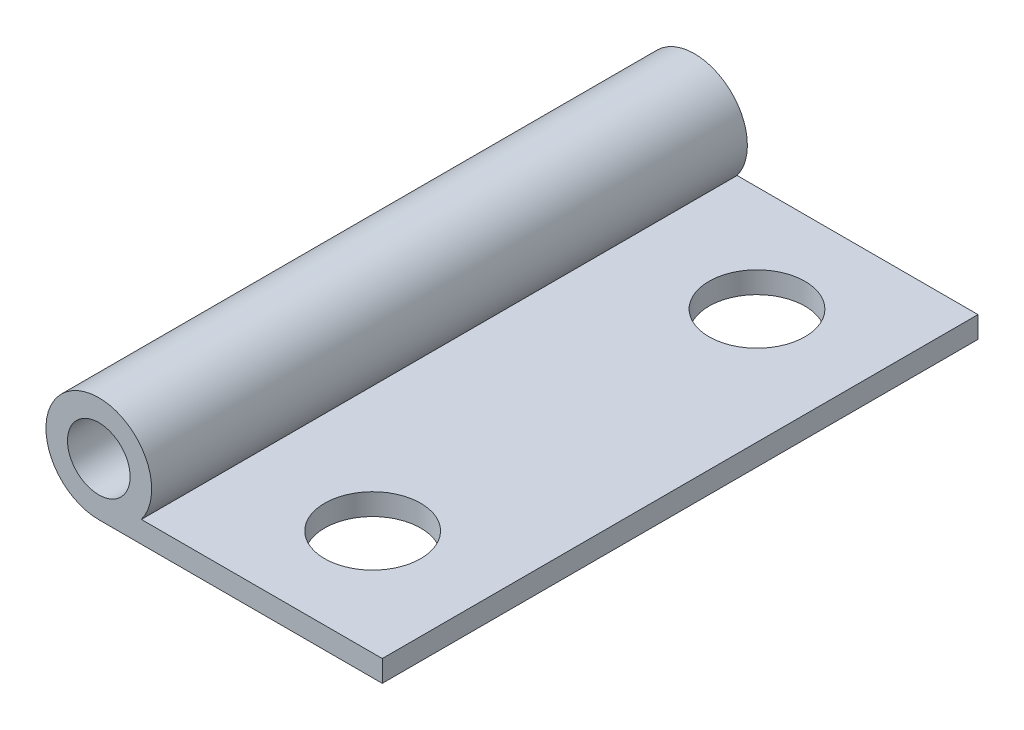
ISO-10303-21;
HEADER;
FILE_DESCRIPTION(('STEP AP214'),'2;1');
FILE_NAME('part.step','',(''),(''),'','','');
FILE_SCHEMA(('AUTOMOTIVE_DESIGN { 1 0 10303 214 1 1 1 1 }'));
ENDSEC;
DATA;
#1=APPLICATION_CONTEXT('core data for automotive mechanical design processes');
#2=APPLICATION_PROTOCOL_DEFINITION('international standard','automotive_design',2000,#1);
#3=PRODUCT_CONTEXT('',#1,'mechanical');
#4=PRODUCT('Part','Part','',(#3));
#5=PRODUCT_RELATED_PRODUCT_CATEGORY('part','',(#4));
#6=PRODUCT_DEFINITION_FORMATION('','',#4);
#7=PRODUCT_DEFINITION_CONTEXT('part definition',#1,'design');
#8=PRODUCT_DEFINITION('design','',#6,#7);
#9=PRODUCT_DEFINITION_SHAPE('','',#8);
#10=(LENGTH_UNIT() NAMED_UNIT(*) SI_UNIT(.MILLI.,.METRE.));
#11=(NAMED_UNIT(*) PLANE_ANGLE_UNIT() SI_UNIT($,.RADIAN.));
#12=(NAMED_UNIT(*) SI_UNIT($,.STERADIAN.) SOLID_ANGLE_UNIT());
#13=UNCERTAINTY_MEASURE_WITH_UNIT(LENGTH_MEASURE(1.E-05),#10,'distance_accuracy_value','');
#14=(GEOMETRIC_REPRESENTATION_CONTEXT(3) GLOBAL_UNCERTAINTY_ASSIGNED_CONTEXT((#13)) GLOBAL_UNIT_ASSIGNED_CONTEXT((#10,
#11,#12)) REPRESENTATION_CONTEXT('',''));
#15=CARTESIAN_POINT('',(0.,0.,0.));
#16=DIRECTION('',(0.,0.,1.));
#17=DIRECTION('',(1.,0.,0.));
#18=AXIS2_PLACEMENT_3D('',#15,#16,#17);
#19=CARTESIAN_POINT('',(0.,1.12,0.));
#20=DIRECTION('',(0.,1.,0.));
#21=DIRECTION('',(0.,0.,1.));
#22=AXIS2_PLACEMENT_3D('',#19,#20,#21);
#23=PLANE('',#22);
#24=CARTESIAN_POINT('',(0.,1.12,-10.));
#25=DIRECTION('',(0.,1.,0.));
#26=DIRECTION('',(0.,0.,1.));
#27=AXIS2_PLACEMENT_3D('',#24,#25,#26);
#28=CIRCLE('',#27,2.5);
#29=CARTESIAN_POINT('',(0.,1.12,-7.5));
#30=VERTEX_POINT('',#29);
#31=EDGE_CURVE('E114',#30,#30,#28,.T.);
#32=ORIENTED_EDGE('',*,*,#31,.F.);
#33=EDGE_LOOP('',(#32));
#34=FACE_BOUND('',#33,.T.);
#35=DIRECTION('',(0.,0.,-1.));
#36=VECTOR('',#35,1.);
#37=CARTESIAN_POINT('',(6.,1.12,-15.5));
#38=LINE('',#37,#36);
#39=CARTESIAN_POINT('',(6.,1.12,15.5));
#40=VERTEX_POINT('',#39);
#41=CARTESIAN_POINT('',(6.,1.12,-15.5));
#42=VERTEX_POINT('',#41);
#43=EDGE_CURVE('E120',#40,#42,#38,.T.);
#44=ORIENTED_EDGE('',*,*,#43,.T.);
#45=DIRECTION('',(-1.,0.,0.));
#46=VECTOR('',#45,1.);
#47=CARTESIAN_POINT('',(-6.,1.12,-15.5));
#48=LINE('',#47,#46);
#49=CARTESIAN_POINT('',(-6.53514108801486,1.12,-15.5));
#50=VERTEX_POINT('',#49);
#51=EDGE_CURVE('E86',#42,#50,#48,.T.);
#52=ORIENTED_EDGE('',*,*,#51,.T.);
#53=DIRECTION('',(0.,0.,1.));
#54=VECTOR('',#53,1.);
#55=CARTESIAN_POINT('',(-6.53514108801486,1.12,-23.278174593052));
#56=LINE('',#55,#54);
#57=CARTESIAN_POINT('',(-6.53514108801486,1.12,15.5));
#58=VERTEX_POINT('',#57);
#59=EDGE_CURVE('E89',#50,#58,#56,.T.);
#60=ORIENTED_EDGE('',*,*,#59,.T.);
#61=DIRECTION('',(1.,0.,0.));
#62=VECTOR('',#61,1.);
#63=CARTESIAN_POINT('',(-6.,1.12,15.5));
#64=LINE('',#63,#62);
#65=EDGE_CURVE('E53',#58,#40,#64,.T.);
#66=ORIENTED_EDGE('',*,*,#65,.T.);
#67=EDGE_LOOP('',(#44,#52,#60,#66));
#68=FACE_BOUND('',#67,.T.);
#69=CARTESIAN_POINT('',(0.,1.12,10.));
#70=DIRECTION('',(0.,1.,0.));
#71=DIRECTION('',(0.,0.,1.));
#72=AXIS2_PLACEMENT_3D('',#69,#70,#71);
#73=CIRCLE('',#72,2.5);
#74=CARTESIAN_POINT('',(0.,1.12,12.5));
#75=VERTEX_POINT('',#74);
#76=EDGE_CURVE('E108',#75,#75,#73,.T.);
#77=ORIENTED_EDGE('',*,*,#76,.F.);
#78=EDGE_LOOP('',(#77));
#79=FACE_BOUND('',#78,.T.);
#80=ADVANCED_FACE('F36',(#34,#68,#79),#23,.T.);
#81=CARTESIAN_POINT('',(0.,0.,0.));
#82=DIRECTION('',(0.,1.,0.));
#83=DIRECTION('',(0.,0.,1.));
#84=AXIS2_PLACEMENT_3D('',#81,#82,#83);
#85=PLANE('',#84);
#86=DIRECTION('',(0.,0.,-1.));
#87=VECTOR('',#86,1.);
#88=CARTESIAN_POINT('',(6.,0.,-15.5));
#89=LINE('',#88,#87);
#90=CARTESIAN_POINT('',(6.,0.,15.5));
#91=VERTEX_POINT('',#90);
#92=CARTESIAN_POINT('',(6.,0.,-15.5));
#93=VERTEX_POINT('',#92);
#94=EDGE_CURVE('E117',#91,#93,#89,.T.);
#95=ORIENTED_EDGE('',*,*,#94,.F.);
#96=DIRECTION('',(1.,0.,0.));
#97=VECTOR('',#96,1.);
#98=CARTESIAN_POINT('',(-6.,0.,15.5));
#99=LINE('',#98,#97);
#100=CARTESIAN_POINT('',(-8.75,0.,15.5));
#101=VERTEX_POINT('',#100);
#102=EDGE_CURVE('E122',#101,#91,#99,.T.);
#103=ORIENTED_EDGE('',*,*,#102,.F.);
#104=DIRECTION('',(0.,0.,1.));
#105=VECTOR('',#104,1.);
#106=CARTESIAN_POINT('',(-8.75,0.,-23.278174593052));
#107=LINE('',#106,#105);
#108=CARTESIAN_POINT('',(-8.75,0.,-15.5));
#109=VERTEX_POINT('',#108);
#110=EDGE_CURVE('E92',#109,#101,#107,.T.);
#111=ORIENTED_EDGE('',*,*,#110,.F.);
#112=DIRECTION('',(-1.,0.,0.));
#113=VECTOR('',#112,1.);
#114=CARTESIAN_POINT('',(-6.,0.,-15.5));
#115=LINE('',#114,#113);
#116=EDGE_CURVE('E65',#93,#109,#115,.T.);
#117=ORIENTED_EDGE('',*,*,#116,.F.);
#118=EDGE_LOOP('',(#95,#103,#111,#117));
#119=FACE_BOUND('',#118,.T.);
#120=CARTESIAN_POINT('',(0.,0.,-10.));
#121=DIRECTION('',(0.,1.,0.));
#122=DIRECTION('',(0.,0.,1.));
#123=AXIS2_PLACEMENT_3D('',#120,#121,#122);
#124=CIRCLE('',#123,2.5);
#125=CARTESIAN_POINT('',(0.,0.,-7.5));
#126=VERTEX_POINT('',#125);
#127=EDGE_CURVE('E111',#126,#126,#124,.T.);
#128=ORIENTED_EDGE('',*,*,#127,.T.);
#129=EDGE_LOOP('',(#128));
#130=FACE_BOUND('',#129,.T.);
#131=CARTESIAN_POINT('',(0.,0.,10.));
#132=DIRECTION('',(0.,1.,0.));
#133=DIRECTION('',(0.,0.,1.));
#134=AXIS2_PLACEMENT_3D('',#131,#132,#133);
#135=CIRCLE('',#134,2.5);
#136=CARTESIAN_POINT('',(0.,0.,12.5));
#137=VERTEX_POINT('',#136);
#138=EDGE_CURVE('E107',#137,#137,#135,.T.);
#139=ORIENTED_EDGE('',*,*,#138,.T.);
#140=EDGE_LOOP('',(#139));
#141=FACE_BOUND('',#140,.T.);
#142=ADVANCED_FACE('F129',(#119,#130,#141),#85,.F.);
#143=CARTESIAN_POINT('',(6.,1.12,-15.5));
#144=DIRECTION('',(-1.,0.,0.));
#145=DIRECTION('',(0.,0.,1.));
#146=AXIS2_PLACEMENT_3D('',#143,#144,#145);
#147=PLANE('',#146);
#148=ORIENTED_EDGE('',*,*,#94,.T.);
#149=DIRECTION('',(0.,-1.,0.));
#150=VECTOR('',#149,1.);
#151=CARTESIAN_POINT('',(6.,1.12,-15.5));
#152=LINE('',#151,#150);
#153=EDGE_CURVE('E11',#42,#93,#152,.T.);
#154=ORIENTED_EDGE('',*,*,#153,.F.);
#155=ORIENTED_EDGE('',*,*,#43,.F.);
#156=DIRECTION('',(0.,-1.,0.));
#157=VECTOR('',#156,1.);
#158=CARTESIAN_POINT('',(6.,1.12,15.5));
#159=LINE('',#158,#157);
#160=EDGE_CURVE('E45',#40,#91,#159,.T.);
#161=ORIENTED_EDGE('',*,*,#160,.T.);
#162=EDGE_LOOP('',(#148,#154,#155,#161));
#163=FACE_BOUND('',#162,.T.);
#164=ADVANCED_FACE('F38',(#163),#147,.F.);
#165=CARTESIAN_POINT('',(-6.,1.12,-15.5));
#166=DIRECTION('',(0.,0.,1.));
#167=DIRECTION('',(1.,0.,0.));
#168=AXIS2_PLACEMENT_3D('',#165,#166,#167);
#169=PLANE('',#168);
#170=ORIENTED_EDGE('',*,*,#116,.T.);
#171=CARTESIAN_POINT('',(-8.75,2.75,-15.5));
#172=DIRECTION('',(0.,0.,1.));
#173=DIRECTION('',(1.,0.,0.));
#174=AXIS2_PLACEMENT_3D('',#171,#172,#173);
#175=CIRCLE('',#174,2.75);
#176=EDGE_CURVE('E102',#109,#50,#175,.F.);
#177=ORIENTED_EDGE('',*,*,#176,.T.);
#178=ORIENTED_EDGE('',*,*,#51,.F.);
#179=ORIENTED_EDGE('',*,*,#153,.T.);
#180=EDGE_LOOP('',(#170,#177,#178,#179));
#181=FACE_BOUND('',#180,.T.);
#182=CARTESIAN_POINT('',(-8.75,2.75,-15.5));
#183=DIRECTION('',(0.,0.,1.));
#184=DIRECTION('',(1.,0.,0.));
#185=AXIS2_PLACEMENT_3D('',#182,#183,#184);
#186=CIRCLE('',#185,1.63);
#187=CARTESIAN_POINT('',(-7.12,2.75,-15.5));
#188=VERTEX_POINT('',#187);
#189=EDGE_CURVE('E104',#188,#188,#186,.F.);
#190=ORIENTED_EDGE('',*,*,#189,.F.);
#191=EDGE_LOOP('',(#190));
#192=FACE_BOUND('',#191,.T.);
#193=ADVANCED_FACE('F158',(#181,#192),#169,.F.);
#194=CARTESIAN_POINT('',(-6.,1.12,15.5));
#195=DIRECTION('',(0.,0.,-1.));
#196=DIRECTION('',(-1.,0.,0.));
#197=AXIS2_PLACEMENT_3D('',#194,#195,#196);
#198=PLANE('',#197);
#199=ORIENTED_EDGE('',*,*,#102,.T.);
#200=ORIENTED_EDGE('',*,*,#160,.F.);
#201=ORIENTED_EDGE('',*,*,#65,.F.);
#202=CARTESIAN_POINT('',(-8.75,2.75,15.5));
#203=DIRECTION('',(0.,0.,1.));
#204=DIRECTION('',(1.,0.,0.));
#205=AXIS2_PLACEMENT_3D('',#202,#203,#204);
#206=CIRCLE('',#205,2.75);
#207=EDGE_CURVE('E83',#58,#101,#206,.T.);
#208=ORIENTED_EDGE('',*,*,#207,.T.);
#209=EDGE_LOOP('',(#199,#200,#201,#208));
#210=FACE_BOUND('',#209,.T.);
#211=CARTESIAN_POINT('',(-8.75,2.75,15.5));
#212=DIRECTION('',(0.,0.,1.));
#213=DIRECTION('',(1.,0.,0.));
#214=AXIS2_PLACEMENT_3D('',#211,#212,#213);
#215=CIRCLE('',#214,1.63);
#216=CARTESIAN_POINT('',(-7.12,2.75,15.5));
#217=VERTEX_POINT('',#216);
#218=EDGE_CURVE('E96',#217,#217,#215,.T.);
#219=ORIENTED_EDGE('',*,*,#218,.F.);
#220=EDGE_LOOP('',(#219));
#221=FACE_BOUND('',#220,.T.);
#222=ADVANCED_FACE('F80',(#210,#221),#198,.F.);
#223=CARTESIAN_POINT('',(0.,1.12,-10.));
#224=DIRECTION('',(0.,-1.,0.));
#225=DIRECTION('',(0.,0.,-1.));
#226=AXIS2_PLACEMENT_3D('',#223,#224,#225);
#227=CYLINDRICAL_SURFACE('',#226,2.5);
#228=ORIENTED_EDGE('',*,*,#31,.T.);
#229=EDGE_LOOP('',(#228));
#230=FACE_BOUND('',#229,.T.);
#231=ORIENTED_EDGE('',*,*,#127,.F.);
#232=EDGE_LOOP('',(#231));
#233=FACE_BOUND('',#232,.T.);
#234=ADVANCED_FACE('F139',(#230,#233),#227,.F.);
#235=CARTESIAN_POINT('',(0.,1.12,10.));
#236=DIRECTION('',(0.,-1.,0.));
#237=DIRECTION('',(0.,0.,-1.));
#238=AXIS2_PLACEMENT_3D('',#235,#236,#237);
#239=CYLINDRICAL_SURFACE('',#238,2.5);
#240=ORIENTED_EDGE('',*,*,#76,.T.);
#241=EDGE_LOOP('',(#240));
#242=FACE_BOUND('',#241,.T.);
#243=ORIENTED_EDGE('',*,*,#138,.F.);
#244=EDGE_LOOP('',(#243));
#245=FACE_BOUND('',#244,.T.);
#246=ADVANCED_FACE('F137',(#242,#245),#239,.F.);
#247=CARTESIAN_POINT('',(-8.75,2.75,-23.278174593052));
#248=DIRECTION('',(0.,0.,1.));
#249=DIRECTION('',(1.,0.,0.));
#250=AXIS2_PLACEMENT_3D('',#247,#248,#249);
#251=CYLINDRICAL_SURFACE('',#250,2.75);
#252=ORIENTED_EDGE('',*,*,#176,.F.);
#253=ORIENTED_EDGE('',*,*,#110,.T.);
#254=ORIENTED_EDGE('',*,*,#207,.F.);
#255=ORIENTED_EDGE('',*,*,#59,.F.);
#256=EDGE_LOOP('',(#252,#253,#254,#255));
#257=FACE_BOUND('',#256,.T.);
#258=ADVANCED_FACE('F95',(#257),#251,.T.);
#259=CARTESIAN_POINT('',(-8.75,2.75,-23.278174593052));
#260=DIRECTION('',(0.,0.,1.));
#261=DIRECTION('',(1.,0.,0.));
#262=AXIS2_PLACEMENT_3D('',#259,#260,#261);
#263=CYLINDRICAL_SURFACE('',#262,1.63);
#264=ORIENTED_EDGE('',*,*,#189,.T.);
#265=EDGE_LOOP('',(#264));
#266=FACE_BOUND('',#265,.T.);
#267=ORIENTED_EDGE('',*,*,#218,.T.);
#268=EDGE_LOOP('',(#267));
#269=FACE_BOUND('',#268,.T.);
#270=ADVANCED_FACE('F146',(#266,#269),#263,.F.);
#271=CLOSED_SHELL('',(#80,#142,#164,#193,#222,#234,#246,#258,#270));
#272=MANIFOLD_SOLID_BREP('B2',#271);
#273=ADVANCED_BREP_SHAPE_REPRESENTATION('',(#18,#272),#14);
#274=SHAPE_DEFINITION_REPRESENTATION(#9,#273);
ENDSEC;
END-ISO-10303-21;
